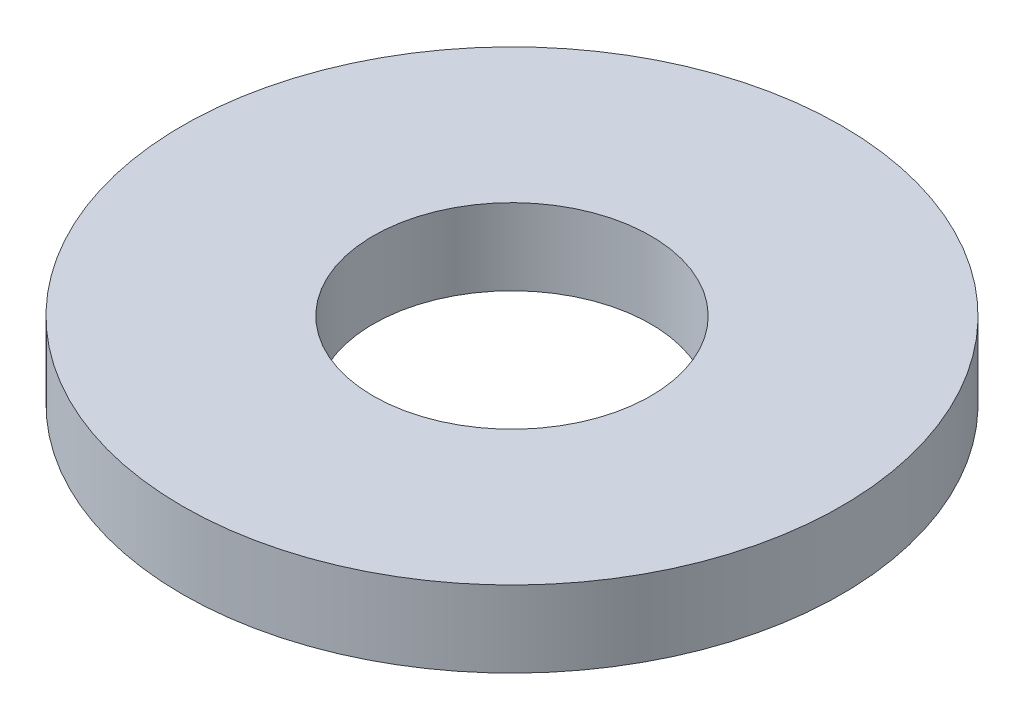
ISO-10303-21;
HEADER;
FILE_DESCRIPTION(('STEP AP214'),'2;1');
FILE_NAME('part.step','',(''),(''),'','','');
FILE_SCHEMA(('AUTOMOTIVE_DESIGN { 1 0 10303 214 1 1 1 1 }'));
ENDSEC;
DATA;
#1=APPLICATION_CONTEXT('core data for automotive mechanical design processes');
#2=APPLICATION_PROTOCOL_DEFINITION('international standard','automotive_design',2000,#1);
#3=PRODUCT_CONTEXT('',#1,'mechanical');
#4=PRODUCT('Part','Part','',(#3));
#5=PRODUCT_RELATED_PRODUCT_CATEGORY('part','',(#4));
#6=PRODUCT_DEFINITION_FORMATION('','',#4);
#7=PRODUCT_DEFINITION_CONTEXT('part definition',#1,'design');
#8=PRODUCT_DEFINITION('design','',#6,#7);
#9=PRODUCT_DEFINITION_SHAPE('','',#8);
#10=(LENGTH_UNIT() NAMED_UNIT(*) SI_UNIT(.MILLI.,.METRE.));
#11=(NAMED_UNIT(*) PLANE_ANGLE_UNIT() SI_UNIT($,.RADIAN.));
#12=(NAMED_UNIT(*) SI_UNIT($,.STERADIAN.) SOLID_ANGLE_UNIT());
#13=UNCERTAINTY_MEASURE_WITH_UNIT(LENGTH_MEASURE(1.E-05),#10,'distance_accuracy_value','');
#14=(GEOMETRIC_REPRESENTATION_CONTEXT(3) GLOBAL_UNCERTAINTY_ASSIGNED_CONTEXT((#13)) GLOBAL_UNIT_ASSIGNED_CONTEXT((#10,
#11,#12)) REPRESENTATION_CONTEXT('',''));
#15=CARTESIAN_POINT('',(0.,0.,0.));
#16=DIRECTION('',(0.,0.,1.));
#17=DIRECTION('',(1.,0.,0.));
#18=AXIS2_PLACEMENT_3D('',#15,#16,#17);
#19=CARTESIAN_POINT('',(0.,22.,0.));
#20=DIRECTION('',(0.,-1.,0.));
#21=DIRECTION('',(0.,0.,-1.));
#22=AXIS2_PLACEMENT_3D('',#19,#20,#21);
#23=CYLINDRICAL_SURFACE('',#22,95.);
#24=CARTESIAN_POINT('',(0.,22.,0.));
#25=DIRECTION('',(0.,1.,0.));
#26=DIRECTION('',(0.,0.,1.));
#27=AXIS2_PLACEMENT_3D('',#24,#25,#26);
#28=CIRCLE('',#27,95.);
#29=CARTESIAN_POINT('',(0.,22.,95.));
#30=VERTEX_POINT('',#29);
#31=EDGE_CURVE('E10',#30,#30,#28,.T.);
#32=ORIENTED_EDGE('',*,*,#31,.F.);
#33=EDGE_LOOP('',(#32));
#34=FACE_BOUND('',#33,.T.);
#35=CARTESIAN_POINT('',(0.,0.,0.));
#36=DIRECTION('',(0.,1.,0.));
#37=DIRECTION('',(0.,0.,1.));
#38=AXIS2_PLACEMENT_3D('',#35,#36,#37);
#39=CIRCLE('',#38,95.);
#40=CARTESIAN_POINT('',(0.,0.,95.));
#41=VERTEX_POINT('',#40);
#42=EDGE_CURVE('E37',#41,#41,#39,.T.);
#43=ORIENTED_EDGE('',*,*,#42,.T.);
#44=EDGE_LOOP('',(#43));
#45=FACE_BOUND('',#44,.T.);
#46=ADVANCED_FACE('F40',(#34,#45),#23,.T.);
#47=CARTESIAN_POINT('',(0.,22.,0.));
#48=DIRECTION('',(0.,1.,0.));
#49=DIRECTION('',(0.,0.,1.));
#50=AXIS2_PLACEMENT_3D('',#47,#48,#49);
#51=PLANE('',#50);
#52=CARTESIAN_POINT('',(0.,22.,0.));
#53=DIRECTION('',(0.,1.,0.));
#54=DIRECTION('',(0.,0.,1.));
#55=AXIS2_PLACEMENT_3D('',#52,#53,#54);
#56=CIRCLE('',#55,40.);
#57=CARTESIAN_POINT('',(0.,22.,40.));
#58=VERTEX_POINT('',#57);
#59=EDGE_CURVE('E50',#58,#58,#56,.T.);
#60=ORIENTED_EDGE('',*,*,#59,.F.);
#61=EDGE_LOOP('',(#60));
#62=FACE_BOUND('',#61,.T.);
#63=ORIENTED_EDGE('',*,*,#31,.T.);
#64=EDGE_LOOP('',(#63));
#65=FACE_BOUND('',#64,.T.);
#66=ADVANCED_FACE('F59',(#62,#65),#51,.T.);
#67=CARTESIAN_POINT('',(0.,0.,0.));
#68=DIRECTION('',(0.,1.,0.));
#69=DIRECTION('',(0.,0.,1.));
#70=AXIS2_PLACEMENT_3D('',#67,#68,#69);
#71=PLANE('',#70);
#72=CARTESIAN_POINT('',(0.,0.,0.));
#73=DIRECTION('',(0.,1.,0.));
#74=DIRECTION('',(0.,0.,1.));
#75=AXIS2_PLACEMENT_3D('',#72,#73,#74);
#76=CIRCLE('',#75,40.);
#77=CARTESIAN_POINT('',(0.,0.,40.));
#78=VERTEX_POINT('',#77);
#79=EDGE_CURVE('E47',#78,#78,#76,.T.);
#80=ORIENTED_EDGE('',*,*,#79,.T.);
#81=EDGE_LOOP('',(#80));
#82=FACE_BOUND('',#81,.T.);
#83=ORIENTED_EDGE('',*,*,#42,.F.);
#84=EDGE_LOOP('',(#83));
#85=FACE_BOUND('',#84,.T.);
#86=ADVANCED_FACE('F58',(#82,#85),#71,.F.);
#87=CARTESIAN_POINT('',(0.,22.,0.));
#88=DIRECTION('',(0.,-1.,0.));
#89=DIRECTION('',(0.,0.,-1.));
#90=AXIS2_PLACEMENT_3D('',#87,#88,#89);
#91=CYLINDRICAL_SURFACE('',#90,40.);
#92=ORIENTED_EDGE('',*,*,#59,.T.);
#93=EDGE_LOOP('',(#92));
#94=FACE_BOUND('',#93,.T.);
#95=ORIENTED_EDGE('',*,*,#79,.F.);
#96=EDGE_LOOP('',(#95));
#97=FACE_BOUND('',#96,.T.);
#98=ADVANCED_FACE('F54',(#94,#97),#91,.F.);
#99=CLOSED_SHELL('',(#46,#66,#86,#98));
#100=MANIFOLD_SOLID_BREP('B2',#99);
#101=ADVANCED_BREP_SHAPE_REPRESENTATION('',(#18,#100),#14);
#102=SHAPE_DEFINITION_REPRESENTATION(#9,#101);
ENDSEC;
END-ISO-10303-21;
